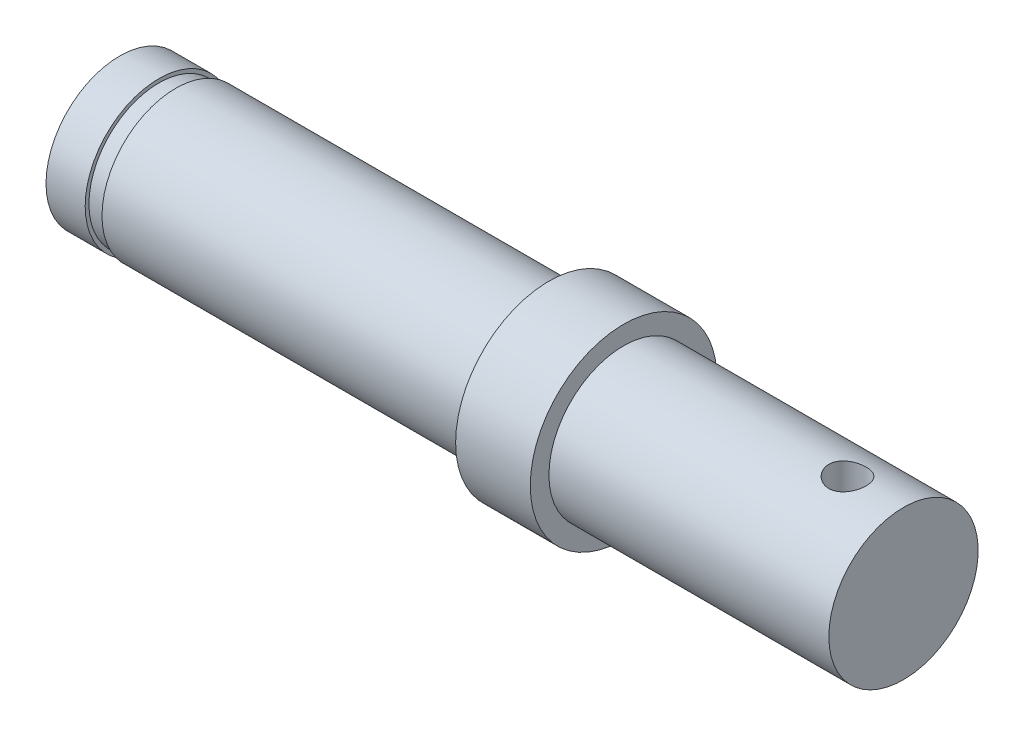
ISO-10303-21;
HEADER;
FILE_DESCRIPTION(('STEP AP214'),'2;1');
FILE_NAME('part.step','',(''),(''),'','','');
FILE_SCHEMA(('AUTOMOTIVE_DESIGN { 1 0 10303 214 1 1 1 1 }'));
ENDSEC;
DATA;
#1=APPLICATION_CONTEXT('core data for automotive mechanical design processes');
#2=APPLICATION_PROTOCOL_DEFINITION('international standard','automotive_design',2000,#1);
#3=PRODUCT_CONTEXT('',#1,'mechanical');
#4=PRODUCT('Part','Part','',(#3));
#5=PRODUCT_RELATED_PRODUCT_CATEGORY('part','',(#4));
#6=PRODUCT_DEFINITION_FORMATION('','',#4);
#7=PRODUCT_DEFINITION_CONTEXT('part definition',#1,'design');
#8=PRODUCT_DEFINITION('design','',#6,#7);
#9=PRODUCT_DEFINITION_SHAPE('','',#8);
#10=(LENGTH_UNIT() NAMED_UNIT(*) SI_UNIT(.MILLI.,.METRE.));
#11=(NAMED_UNIT(*) PLANE_ANGLE_UNIT() SI_UNIT($,.RADIAN.));
#12=(NAMED_UNIT(*) SI_UNIT($,.STERADIAN.) SOLID_ANGLE_UNIT());
#13=UNCERTAINTY_MEASURE_WITH_UNIT(LENGTH_MEASURE(1.E-05),#10,'distance_accuracy_value','');
#14=(GEOMETRIC_REPRESENTATION_CONTEXT(3) GLOBAL_UNCERTAINTY_ASSIGNED_CONTEXT((#13)) GLOBAL_UNIT_ASSIGNED_CONTEXT((#10,
#11,#12)) REPRESENTATION_CONTEXT('',''));
#15=CARTESIAN_POINT('',(0.,0.,0.));
#16=DIRECTION('',(0.,0.,1.));
#17=DIRECTION('',(1.,0.,0.));
#18=AXIS2_PLACEMENT_3D('',#15,#16,#17);
#19=CARTESIAN_POINT('',(-15.4994299751339,3.95,0.));
#20=DIRECTION('',(1.,0.,0.));
#21=DIRECTION('',(0.,0.,-1.));
#22=AXIS2_PLACEMENT_3D('',#19,#20,#21);
#23=PLANE('',#22);
#24=CARTESIAN_POINT('',(-15.4994299751339,0.,0.));
#25=DIRECTION('',(-1.,0.,0.));
#26=DIRECTION('',(0.,0.,1.));
#27=AXIS2_PLACEMENT_3D('',#24,#25,#26);
#28=CIRCLE('',#27,3.95);
#29=CARTESIAN_POINT('',(-15.4994299751339,0.,3.95));
#30=VERTEX_POINT('',#29);
#31=EDGE_CURVE('E122',#30,#30,#28,.T.);
#32=ORIENTED_EDGE('',*,*,#31,.T.);
#33=EDGE_LOOP('',(#32));
#34=FACE_BOUND('',#33,.T.);
#35=ADVANCED_FACE('F45',(#34),#23,.F.);
#36=CARTESIAN_POINT('',(26.5005700248661,0.,0.));
#37=DIRECTION('',(-1.,0.,0.));
#38=DIRECTION('',(0.,0.,1.));
#39=AXIS2_PLACEMENT_3D('',#36,#37,#38);
#40=PLANE('',#39);
#41=CARTESIAN_POINT('',(26.5005700248661,0.,0.));
#42=DIRECTION('',(-1.,0.,0.));
#43=DIRECTION('',(0.,0.,1.));
#44=AXIS2_PLACEMENT_3D('',#41,#42,#43);
#45=CIRCLE('',#44,4.00000000000001);
#46=CARTESIAN_POINT('',(26.5005700248661,0.,4.00000000000001));
#47=VERTEX_POINT('',#46);
#48=EDGE_CURVE('E12',#47,#47,#45,.T.);
#49=ORIENTED_EDGE('',*,*,#48,.F.);
#50=EDGE_LOOP('',(#49));
#51=FACE_BOUND('',#50,.T.);
#52=ADVANCED_FACE('F110',(#51),#40,.F.);
#53=CARTESIAN_POINT('',(-15.4994299751339,0.,0.));
#54=DIRECTION('',(-1.,0.,0.));
#55=DIRECTION('',(0.,0.,1.));
#56=AXIS2_PLACEMENT_3D('',#53,#54,#55);
#57=CYLINDRICAL_SURFACE('',#56,4.);
#58=CARTESIAN_POINT('',(23.5005700248661,-3.87298334620742,1.));
#59=CARTESIAN_POINT('',(23.5557903252229,-3.87298440057185,0.9999984314387));
#60=CARTESIAN_POINT('',(23.6110279842975,-3.87417722499279,0.995410498208071));
#61=CARTESIAN_POINT('',(23.7199170560987,-3.8788074489225,0.977209250194448));
#62=CARTESIAN_POINT('',(23.7735675266461,-3.88224615474181,0.963590682698079));
#63=CARTESIAN_POINT('',(23.8776914401539,-3.89095489813012,0.927796479849636));
#64=CARTESIAN_POINT('',(23.9281688870239,-3.8962225706936,0.905631891140945));
#65=CARTESIAN_POINT('',(24.0246943658786,-3.90799276818328,0.853408456505409));
#66=CARTESIAN_POINT('',(24.0707422096973,-3.91449534553241,0.823349275424507));
#67=CARTESIAN_POINT('',(24.158114682972,-3.92816286540369,0.755483370924519));
#68=CARTESIAN_POINT('',(24.1993274650064,-3.93533839048709,0.717534755081559));
#69=CARTESIAN_POINT('',(24.27487458261,-3.94945150206622,0.635272825640329));
#70=CARTESIAN_POINT('',(24.3092082751147,-3.95638906626692,0.590958917672141));
#71=CARTESIAN_POINT('',(24.3704802119187,-3.96936166208095,0.496458080431566));
#72=CARTESIAN_POINT('',(24.3973085801307,-3.97538274960201,0.446197830478045));
#73=CARTESIAN_POINT('',(24.4420938825273,-3.98572324770431,0.34170527371711));
#74=CARTESIAN_POINT('',(24.4600521256323,-3.99004290933748,0.287473554316778));
#75=CARTESIAN_POINT('',(24.4862291586975,-3.99641903539263,0.177743503501663));
#76=CARTESIAN_POINT('',(24.4946378825967,-3.99851957537724,0.12229308781959));
#77=CARTESIAN_POINT('',(24.5020733765763,-4.00037437642922,0.0107315277051081));
#78=CARTESIAN_POINT('',(24.5011015337499,-4.00012898438683,-0.0453795178152274));
#79=CARTESIAN_POINT('',(24.4899400847661,-3.99735237981414,-0.155352247172388));
#80=CARTESIAN_POINT('',(24.4799554948446,-3.9948720093635,-0.209236215601067));
#81=CARTESIAN_POINT('',(24.4513815168467,-3.98796334609942,-0.314538247413687));
#82=CARTESIAN_POINT('',(24.4327916707151,-3.98353494959377,-0.365956179370439));
#83=CARTESIAN_POINT('',(24.3873689965913,-3.97315003880359,-0.465406703501807));
#84=CARTESIAN_POINT('',(24.3604632070014,-3.96718007878022,-0.513404509766505));
#85=CARTESIAN_POINT('',(24.2992277532196,-3.9543596152386,-0.604275622340489));
#86=CARTESIAN_POINT('',(24.2648967974419,-3.94750895860996,-0.647148035085506));
#87=CARTESIAN_POINT('',(24.1886865280732,-3.93345485507809,-0.727774035084958));
#88=CARTESIAN_POINT('',(24.146628067927,-3.92624687810368,-0.765357679075201));
#89=CARTESIAN_POINT('',(24.05673003545,-3.91246017406683,-0.83297637596302));
#90=CARTESIAN_POINT('',(24.0088901930697,-3.90588147642389,-0.863011076046018));
#91=CARTESIAN_POINT('',(23.9084540112065,-3.8940819873266,-0.914788129022599));
#92=CARTESIAN_POINT('',(23.8558357327408,-3.88886793490289,-0.936489566970492));
#93=CARTESIAN_POINT('',(23.7475358376355,-3.88047456055983,-0.970685620636342));
#94=CARTESIAN_POINT('',(23.6918548792729,-3.87729480324088,-0.983182206552911));
#95=CARTESIAN_POINT('',(23.5805862242569,-3.87342142415657,-0.998331855466072));
#96=CARTESIAN_POINT('',(23.5250349075343,-3.8726643563746,-1.00123618956785));
#97=CARTESIAN_POINT('',(23.4142412502348,-3.87354937392416,-0.99780679620622));
#98=CARTESIAN_POINT('',(23.3589988816856,-3.87519123840507,-0.991473919139521));
#99=CARTESIAN_POINT('',(23.2513243188842,-3.88062832781825,-0.969970185575066));
#100=CARTESIAN_POINT('',(23.1988609342378,-3.8843878809375,-0.954945627312699));
#101=CARTESIAN_POINT('',(23.0971974417254,-3.89360287308385,-0.916647232668249));
#102=CARTESIAN_POINT('',(23.047997721244,-3.89905851299446,-0.89337241908502));
#103=CARTESIAN_POINT('',(22.9531935137192,-3.91118454837305,-0.838708267174625));
#104=CARTESIAN_POINT('',(22.9076784888489,-3.91787667442657,-0.807168701534253));
#105=CARTESIAN_POINT('',(22.8224946797456,-3.93166833228687,-0.737060292934457));
#106=CARTESIAN_POINT('',(22.7828268582061,-3.93876793091388,-0.698490294805441));
#107=CARTESIAN_POINT('',(22.7094456078377,-3.95278961212643,-0.614262720984727));
#108=CARTESIAN_POINT('',(22.6759059998466,-3.95970280824735,-0.568451952531595));
#109=CARTESIAN_POINT('',(22.6169956780856,-3.97238886645494,-0.471702682694678));
#110=CARTESIAN_POINT('',(22.5916245382228,-3.97816178801584,-0.420764448957592));
#111=CARTESIAN_POINT('',(22.5499916110549,-3.98788046295326,-0.315558201731091));
#112=CARTESIAN_POINT('',(22.5336643111145,-3.99183932008964,-0.261317381027882));
#113=CARTESIAN_POINT('',(22.5103858910227,-3.99754117358316,-0.150749760318808));
#114=CARTESIAN_POINT('',(22.5034329613705,-3.99928459757364,-0.094423365041244));
#115=CARTESIAN_POINT('',(22.4992024352906,-4.00034169408812,0.0170835264433263));
#116=CARTESIAN_POINT('',(22.5016683157707,-3.99971978880009,0.0722538269660332));
#117=CARTESIAN_POINT('',(22.5156178521604,-3.99625896457424,0.18136749641474));
#118=CARTESIAN_POINT('',(22.5271012398792,-3.99342011157095,0.235310901780887));
#119=CARTESIAN_POINT('',(22.558622244637,-3.98585432853964,0.340171035644816));
#120=CARTESIAN_POINT('',(22.5786134781807,-3.98113764502669,0.391102494581019));
#121=CARTESIAN_POINT('',(22.6265406038854,-3.97031288913382,0.488917053041468));
#122=CARTESIAN_POINT('',(22.6544774975357,-3.96420464137727,0.535799641265051));
#123=CARTESIAN_POINT('',(22.7182852588632,-3.95107249681343,0.625401928423901));
#124=CARTESIAN_POINT('',(22.7543301677735,-3.94403016945647,0.667994988300587));
#125=CARTESIAN_POINT('',(22.8329928768399,-3.92990649053207,0.746615020271252));
#126=CARTESIAN_POINT('',(22.8756123409641,-3.92282512952424,0.782640325068179));
#127=CARTESIAN_POINT('',(22.9671714390674,-3.90927475860683,0.847762026479241));
#128=CARTESIAN_POINT('',(23.0162141482786,-3.90281963730391,0.876716619446594));
#129=CARTESIAN_POINT('',(23.118625514789,-3.8914395555011,0.925926896615623));
#130=CARTESIAN_POINT('',(23.1719909909734,-3.88651348244815,0.946188909759558));
#131=CARTESIAN_POINT('',(23.2711470366924,-3.87951908741315,0.974422528565573));
#132=CARTESIAN_POINT('',(23.3164631892485,-3.87708663005762,0.98399317059583));
#133=CARTESIAN_POINT('',(23.4080388938676,-3.87381838580358,0.996782292572821));
#134=CARTESIAN_POINT('',(23.4542983651167,-3.87298246270639,1.00000131437052));
#135=CARTESIAN_POINT('',(23.5005700248661,-3.87298334620742,1.));
#136=B_SPLINE_CURVE_WITH_KNOTS('',3,(#58,#59,#60,#61,#62,#63,#64,#65,#66,#67,#68,#69,#70,#71,
#72,#73,#74,#75,#76,#77,#78,#79,#80,#81,#82,#83,#84,#85,#86,#87,#88,#89,#90,#91,#92,#93,#94,#95,
#96,#97,#98,#99,#100,#101,#102,#103,#104,#105,#106,#107,#108,#109,#110,#111,#112,#113,#114,#115,
#116,#117,#118,#119,#120,#121,#122,#123,#124,#125,#126,#127,#128,#129,#130,#131,#132,#133,#134,
#135),.UNSPECIFIED.,.T.,.F.,(4,2,2,2,2,2,2,2,2,2,2,2,2,2,2,2,2,2,2,2,2,2,2,2,2,2,2,2,2,2,2,2,2,
2,2,2,2,2,4),(0.,0.16549097667523,0.331078296534212,0.496452290829149,0.66183330698466,
0.83049581673465,0.999174085882213,1.17020598555443,1.34121263935112,1.50875500394413,
1.67627259462683,1.84007305071854,2.00388222686189,2.16917149698053,2.3344895418384,
2.5042818662504,2.67408212476196,2.84470572799636,3.01529280048094,3.18137429900962,
3.34744050869796,3.51078961999958,3.67415808564842,3.84073138339938,4.00733207550293,
4.17810132382403,4.34886166284097,4.51836829119047,4.6878421955989,4.85273378447258,
5.01762046947068,5.18161950620159,5.34563922291504,5.51358838629104,5.68158012622479,
5.85270590910146,6.02370688542923,6.16239130867208,6.30106390036084),.UNSPECIFIED.);
#137=CARTESIAN_POINT('',(23.5005700248661,-3.87298334620742,1.));
#138=VERTEX_POINT('',#137);
#139=EDGE_CURVE('E48',#138,#138,#136,.T.);
#140=ORIENTED_EDGE('',*,*,#139,.T.);
#141=EDGE_LOOP('',(#140));
#142=FACE_BOUND('',#141,.T.);
#143=CARTESIAN_POINT('',(23.5005700248661,3.87298334620742,1.));
#144=CARTESIAN_POINT('',(23.4453497245093,3.87298440057185,0.9999984314387));
#145=CARTESIAN_POINT('',(23.3901120654347,3.87417722499279,0.99541049820807));
#146=CARTESIAN_POINT('',(23.2812229936335,3.8788074489225,0.977209250194447));
#147=CARTESIAN_POINT('',(23.2275725230861,3.88224615474181,0.963590682698078));
#148=CARTESIAN_POINT('',(23.1234486095783,3.89095489813012,0.927796479849635));
#149=CARTESIAN_POINT('',(23.0729711627083,3.8962225706936,0.905631891140943));
#150=CARTESIAN_POINT('',(22.9764456838536,3.90799276818328,0.853408456505406));
#151=CARTESIAN_POINT('',(22.930397840035,3.91449534553241,0.823349275424505));
#152=CARTESIAN_POINT('',(22.8430253667603,3.92816286540369,0.755483370924519));
#153=CARTESIAN_POINT('',(22.8018125847258,3.93533839048709,0.717534755081559));
#154=CARTESIAN_POINT('',(22.7262654671222,3.94945150206622,0.635272825640329));
#155=CARTESIAN_POINT('',(22.6919317746175,3.95638906626692,0.590958917672141));
#156=CARTESIAN_POINT('',(22.6306598378135,3.96936166208095,0.496458080431566));
#157=CARTESIAN_POINT('',(22.6038314696015,3.97538274960201,0.446197830478045));
#158=CARTESIAN_POINT('',(22.5590461672049,3.98572324770431,0.34170527371711));
#159=CARTESIAN_POINT('',(22.5410879240999,3.99004290933748,0.287473554316778));
#160=CARTESIAN_POINT('',(22.5149108910347,3.99641903539263,0.177743503501663));
#161=CARTESIAN_POINT('',(22.5065021671355,3.99851957537724,0.12229308781959));
#162=CARTESIAN_POINT('',(22.4990666731559,4.00037437642922,0.0107315277051081));
#163=CARTESIAN_POINT('',(22.5000385159823,4.00012898438683,-0.0453795178152274));
#164=CARTESIAN_POINT('',(22.5111999649662,3.99735237981414,-0.155352247172388));
#165=CARTESIAN_POINT('',(22.5211845548877,3.9948720093635,-0.209236215601067));
#166=CARTESIAN_POINT('',(22.5497585328855,3.98796334609942,-0.314538247413687));
#167=CARTESIAN_POINT('',(22.5683483790171,3.98353494959377,-0.365956179370439));
#168=CARTESIAN_POINT('',(22.6137710531409,3.97315003880359,-0.465406703501807));
#169=CARTESIAN_POINT('',(22.6406768427308,3.96718007878022,-0.513404509766505));
#170=CARTESIAN_POINT('',(22.7019122965126,3.9543596152386,-0.604275622340489));
#171=CARTESIAN_POINT('',(22.7362432522904,3.94750895860996,-0.647148035085506));
#172=CARTESIAN_POINT('',(22.8124535216591,3.93345485507809,-0.727774035084958));
#173=CARTESIAN_POINT('',(22.8545119818052,3.92624687810368,-0.765357679075201));
#174=CARTESIAN_POINT('',(22.9444100142822,3.91246017406683,-0.83297637596302));
#175=CARTESIAN_POINT('',(22.9922498566625,3.90588147642389,-0.863011076046018));
#176=CARTESIAN_POINT('',(23.0926860385257,3.8940819873266,-0.914788129022599));
#177=CARTESIAN_POINT('',(23.1453043169914,3.88886793490289,-0.936489566970492));
#178=CARTESIAN_POINT('',(23.2536042120967,3.88047456055983,-0.970685620636342));
#179=CARTESIAN_POINT('',(23.3092851704594,3.87729480324088,-0.983182206552911));
#180=CARTESIAN_POINT('',(23.4205538254754,3.87342142415657,-0.998331855466072));
#181=CARTESIAN_POINT('',(23.476105142198,3.8726643563746,-1.00123618956785));
#182=CARTESIAN_POINT('',(23.5868987994974,3.87354937392416,-0.99780679620622));
#183=CARTESIAN_POINT('',(23.6421411680466,3.87519123840507,-0.991473919139521));
#184=CARTESIAN_POINT('',(23.749815730848,3.88062832781825,-0.969970185575066));
#185=CARTESIAN_POINT('',(23.8022791154944,3.8843878809375,-0.954945627312699));
#186=CARTESIAN_POINT('',(23.9039426080068,3.89360287308385,-0.916647232668249));
#187=CARTESIAN_POINT('',(23.9531423284882,3.89905851299446,-0.89337241908502));
#188=CARTESIAN_POINT('',(24.047946536013,3.91118454837305,-0.838708267174625));
#189=CARTESIAN_POINT('',(24.0934615608833,3.91787667442657,-0.807168701534253));
#190=CARTESIAN_POINT('',(24.1786453699866,3.93166833228687,-0.737060292934457));
#191=CARTESIAN_POINT('',(24.2183131915261,3.93876793091388,-0.69849029480544));
#192=CARTESIAN_POINT('',(24.2916944418945,3.95278961212643,-0.614262720984726));
#193=CARTESIAN_POINT('',(24.3252340498856,3.95970280824735,-0.568451952531593));
#194=CARTESIAN_POINT('',(24.3841443716466,3.97238886645494,-0.471702682694676));
#195=CARTESIAN_POINT('',(24.4095155115094,3.97816178801584,-0.420764448957591));
#196=CARTESIAN_POINT('',(24.4511484386773,3.98788046295326,-0.315558201731091));
#197=CARTESIAN_POINT('',(24.4674757386177,3.99183932008964,-0.261317381027882));
#198=CARTESIAN_POINT('',(24.4907541587095,3.99754117358316,-0.150749760318808));
#199=CARTESIAN_POINT('',(24.4977070883617,3.99928459757364,-0.094423365041244));
#200=CARTESIAN_POINT('',(24.5019376144416,4.00034169408812,0.0170835264433263));
#201=CARTESIAN_POINT('',(24.4994717339615,3.99971978880009,0.0722538269660332));
#202=CARTESIAN_POINT('',(24.4855221975718,3.99625896457424,0.18136749641474));
#203=CARTESIAN_POINT('',(24.474038809853,3.99342011157095,0.235310901780887));
#204=CARTESIAN_POINT('',(24.4425178050952,3.98585432853964,0.340171035644816));
#205=CARTESIAN_POINT('',(24.4225265715515,3.98113764502669,0.391102494581019));
#206=CARTESIAN_POINT('',(24.3745994458468,3.97031288913382,0.488917053041468));
#207=CARTESIAN_POINT('',(24.3466625521965,3.96420464137727,0.535799641265051));
#208=CARTESIAN_POINT('',(24.282854790869,3.95107249681343,0.625401928423901));
#209=CARTESIAN_POINT('',(24.2468098819587,3.94403016945647,0.667994988300587));
#210=CARTESIAN_POINT('',(24.1681471728923,3.92990649053207,0.746615020271252));
#211=CARTESIAN_POINT('',(24.1255277087682,3.92282512952424,0.782640325068179));
#212=CARTESIAN_POINT('',(24.0339686106648,3.90927475860683,0.847762026479241));
#213=CARTESIAN_POINT('',(23.9849259014536,3.90281963730391,0.876716619446594));
#214=CARTESIAN_POINT('',(23.8825145349433,3.8914395555011,0.925926896615623));
#215=CARTESIAN_POINT('',(23.8291490587588,3.88651348244815,0.946188909759558));
#216=CARTESIAN_POINT('',(23.7299930130398,3.87951908741315,0.974422528565573));
#217=CARTESIAN_POINT('',(23.6846768604837,3.87708663005762,0.98399317059583));
#218=CARTESIAN_POINT('',(23.5931011558646,3.87381838580358,0.996782292572821));
#219=CARTESIAN_POINT('',(23.5468416846155,3.87298246270639,1.00000131437052));
#220=CARTESIAN_POINT('',(23.5005700248661,3.87298334620742,1.));
#221=B_SPLINE_CURVE_WITH_KNOTS('',3,(#143,#144,#145,#146,#147,#148,#149,#150,#151,#152,#153,
#154,#155,#156,#157,#158,#159,#160,#161,#162,#163,#164,#165,#166,#167,#168,#169,#170,#171,#172,
#173,#174,#175,#176,#177,#178,#179,#180,#181,#182,#183,#184,#185,#186,#187,#188,#189,#190,#191,
#192,#193,#194,#195,#196,#197,#198,#199,#200,#201,#202,#203,#204,#205,#206,#207,#208,#209,#210,
#211,#212,#213,#214,#215,#216,#217,#218,#219,#220),.UNSPECIFIED.,.T.,.F.,(4,2,2,2,2,2,2,2,2,2,2,
2,2,2,2,2,2,2,2,2,2,2,2,2,2,2,2,2,2,2,2,2,2,2,2,2,2,2,4),(0.,0.165490976675234,
0.331078296534212,0.496452290829157,0.66183330698466,0.83049581673465,0.999174085882213,
1.17020598555443,1.34121263935112,1.50875500394413,1.67627259462683,1.84007305071854,
2.00388222686189,2.16917149698053,2.3344895418384,2.5042818662504,2.67408212476196,
2.84470572799636,3.01529280048094,3.18137429900962,3.34744050869796,3.51078961999958,
3.67415808564842,3.84073138339938,4.00733207550293,4.17810132382403,4.34886166284097,
4.51836829119047,4.6878421955989,4.85273378447258,5.01762046947068,5.18161950620159,
5.34563922291504,5.51358838629104,5.68158012622479,5.85270590910146,6.02370688542923,
6.16239130867208,6.30106390036084),.UNSPECIFIED.);
#222=CARTESIAN_POINT('',(23.5005700248661,3.87298334620742,1.));
#223=VERTEX_POINT('',#222);
#224=EDGE_CURVE('E64',#223,#223,#221,.T.);
#225=ORIENTED_EDGE('',*,*,#224,.T.);
#226=EDGE_LOOP('',(#225));
#227=FACE_BOUND('',#226,.T.);
#228=CARTESIAN_POINT('',(11.5005700248661,0.,0.));
#229=DIRECTION('',(-1.,0.,0.));
#230=DIRECTION('',(0.,0.,1.));
#231=AXIS2_PLACEMENT_3D('',#228,#229,#230);
#232=CIRCLE('',#231,4.);
#233=CARTESIAN_POINT('',(11.5005700248661,0.,4.));
#234=VERTEX_POINT('',#233);
#235=EDGE_CURVE('E56',#234,#234,#232,.T.);
#236=ORIENTED_EDGE('',*,*,#235,.F.);
#237=EDGE_LOOP('',(#236));
#238=FACE_BOUND('',#237,.T.);
#239=ORIENTED_EDGE('',*,*,#48,.T.);
#240=EDGE_LOOP('',(#239));
#241=FACE_BOUND('',#240,.T.);
#242=ADVANCED_FACE('F68',(#142,#227,#238,#241),#57,.T.);
#243=CARTESIAN_POINT('',(11.5005700248661,4.,0.));
#244=DIRECTION('',(-1.,0.,0.));
#245=DIRECTION('',(0.,0.,1.));
#246=AXIS2_PLACEMENT_3D('',#243,#244,#245);
#247=PLANE('',#246);
#248=CARTESIAN_POINT('',(11.5005700248661,0.,0.));
#249=DIRECTION('',(-1.,0.,0.));
#250=DIRECTION('',(0.,0.,1.));
#251=AXIS2_PLACEMENT_3D('',#248,#249,#250);
#252=CIRCLE('',#251,5.);
#253=CARTESIAN_POINT('',(11.5005700248661,0.,5.));
#254=VERTEX_POINT('',#253);
#255=EDGE_CURVE('E61',#254,#254,#252,.T.);
#256=ORIENTED_EDGE('',*,*,#255,.F.);
#257=EDGE_LOOP('',(#256));
#258=FACE_BOUND('',#257,.T.);
#259=ORIENTED_EDGE('',*,*,#235,.T.);
#260=EDGE_LOOP('',(#259));
#261=FACE_BOUND('',#260,.T.);
#262=ADVANCED_FACE('F103',(#258,#261),#247,.F.);
#263=CARTESIAN_POINT('',(-15.4994299751339,0.,0.));
#264=DIRECTION('',(-1.,0.,0.));
#265=DIRECTION('',(0.,0.,1.));
#266=AXIS2_PLACEMENT_3D('',#263,#264,#265);
#267=CYLINDRICAL_SURFACE('',#266,5.);
#268=CARTESIAN_POINT('',(7.50057002486611,0.,0.));
#269=DIRECTION('',(-1.,0.,0.));
#270=DIRECTION('',(0.,0.,1.));
#271=AXIS2_PLACEMENT_3D('',#268,#269,#270);
#272=CIRCLE('',#271,5.);
#273=CARTESIAN_POINT('',(7.50057002486611,0.,5.));
#274=VERTEX_POINT('',#273);
#275=EDGE_CURVE('E141',#274,#274,#272,.T.);
#276=ORIENTED_EDGE('',*,*,#275,.F.);
#277=EDGE_LOOP('',(#276));
#278=FACE_BOUND('',#277,.T.);
#279=ORIENTED_EDGE('',*,*,#255,.T.);
#280=EDGE_LOOP('',(#279));
#281=FACE_BOUND('',#280,.T.);
#282=ADVANCED_FACE('F100',(#278,#281),#267,.T.);
#283=CARTESIAN_POINT('',(7.50057002486611,5.,0.));
#284=DIRECTION('',(1.,0.,0.));
#285=DIRECTION('',(0.,0.,-1.));
#286=AXIS2_PLACEMENT_3D('',#283,#284,#285);
#287=PLANE('',#286);
#288=CARTESIAN_POINT('',(7.5005700248661,0.,0.));
#289=DIRECTION('',(-1.,0.,0.));
#290=DIRECTION('',(0.,0.,1.));
#291=AXIS2_PLACEMENT_3D('',#288,#289,#290);
#292=CIRCLE('',#291,3.95);
#293=CARTESIAN_POINT('',(7.5005700248661,0.,3.95));
#294=VERTEX_POINT('',#293);
#295=EDGE_CURVE('E138',#294,#294,#292,.T.);
#296=ORIENTED_EDGE('',*,*,#295,.F.);
#297=EDGE_LOOP('',(#296));
#298=FACE_BOUND('',#297,.T.);
#299=ORIENTED_EDGE('',*,*,#275,.T.);
#300=EDGE_LOOP('',(#299));
#301=FACE_BOUND('',#300,.T.);
#302=ADVANCED_FACE('F96',(#298,#301),#287,.F.);
#303=CARTESIAN_POINT('',(-15.4994299751339,0.,0.));
#304=DIRECTION('',(-1.,0.,0.));
#305=DIRECTION('',(0.,0.,1.));
#306=AXIS2_PLACEMENT_3D('',#303,#304,#305);
#307=CYLINDRICAL_SURFACE('',#306,3.95);
#308=CARTESIAN_POINT('',(-12.4994299751339,0.,0.));
#309=DIRECTION('',(-1.,0.,0.));
#310=DIRECTION('',(0.,0.,1.));
#311=AXIS2_PLACEMENT_3D('',#308,#309,#310);
#312=CIRCLE('',#311,3.95);
#313=CARTESIAN_POINT('',(-12.4994299751339,0.,3.95));
#314=VERTEX_POINT('',#313);
#315=EDGE_CURVE('E135',#314,#314,#312,.T.);
#316=ORIENTED_EDGE('',*,*,#315,.F.);
#317=EDGE_LOOP('',(#316));
#318=FACE_BOUND('',#317,.T.);
#319=ORIENTED_EDGE('',*,*,#295,.T.);
#320=EDGE_LOOP('',(#319));
#321=FACE_BOUND('',#320,.T.);
#322=ADVANCED_FACE('F92',(#318,#321),#307,.T.);
#323=CARTESIAN_POINT('',(-12.4994299751339,3.75,0.));
#324=DIRECTION('',(1.,0.,0.));
#325=DIRECTION('',(0.,0.,-1.));
#326=AXIS2_PLACEMENT_3D('',#323,#324,#325);
#327=PLANE('',#326);
#328=CARTESIAN_POINT('',(-12.4994299751339,0.,0.));
#329=DIRECTION('',(-1.,0.,0.));
#330=DIRECTION('',(0.,0.,1.));
#331=AXIS2_PLACEMENT_3D('',#328,#329,#330);
#332=CIRCLE('',#331,3.75);
#333=CARTESIAN_POINT('',(-12.4994299751339,0.,3.75));
#334=VERTEX_POINT('',#333);
#335=EDGE_CURVE('E132',#334,#334,#332,.T.);
#336=ORIENTED_EDGE('',*,*,#335,.F.);
#337=EDGE_LOOP('',(#336));
#338=FACE_BOUND('',#337,.T.);
#339=ORIENTED_EDGE('',*,*,#315,.T.);
#340=EDGE_LOOP('',(#339));
#341=FACE_BOUND('',#340,.T.);
#342=ADVANCED_FACE('F88',(#338,#341),#327,.F.);
#343=CARTESIAN_POINT('',(-15.4994299751339,0.,0.));
#344=DIRECTION('',(-1.,0.,0.));
#345=DIRECTION('',(0.,0.,1.));
#346=AXIS2_PLACEMENT_3D('',#343,#344,#345);
#347=CYLINDRICAL_SURFACE('',#346,3.75);
#348=CARTESIAN_POINT('',(-13.3994299751339,0.,0.));
#349=DIRECTION('',(-1.,0.,0.));
#350=DIRECTION('',(0.,0.,1.));
#351=AXIS2_PLACEMENT_3D('',#348,#349,#350);
#352=CIRCLE('',#351,3.75);
#353=CARTESIAN_POINT('',(-13.3994299751339,0.,3.75));
#354=VERTEX_POINT('',#353);
#355=EDGE_CURVE('E126',#354,#354,#352,.T.);
#356=ORIENTED_EDGE('',*,*,#355,.F.);
#357=EDGE_LOOP('',(#356));
#358=FACE_BOUND('',#357,.T.);
#359=ORIENTED_EDGE('',*,*,#335,.T.);
#360=EDGE_LOOP('',(#359));
#361=FACE_BOUND('',#360,.T.);
#362=ADVANCED_FACE('F84',(#358,#361),#347,.T.);
#363=CARTESIAN_POINT('',(-13.3994299751339,3.95,0.));
#364=DIRECTION('',(-1.,0.,0.));
#365=DIRECTION('',(0.,0.,1.));
#366=AXIS2_PLACEMENT_3D('',#363,#364,#365);
#367=PLANE('',#366);
#368=CARTESIAN_POINT('',(-13.3994299751339,0.,0.));
#369=DIRECTION('',(-1.,0.,0.));
#370=DIRECTION('',(0.,0.,1.));
#371=AXIS2_PLACEMENT_3D('',#368,#369,#370);
#372=CIRCLE('',#371,3.95);
#373=CARTESIAN_POINT('',(-13.3994299751339,0.,3.95));
#374=VERTEX_POINT('',#373);
#375=EDGE_CURVE('E123',#374,#374,#372,.T.);
#376=ORIENTED_EDGE('',*,*,#375,.F.);
#377=EDGE_LOOP('',(#376));
#378=FACE_BOUND('',#377,.T.);
#379=ORIENTED_EDGE('',*,*,#355,.T.);
#380=EDGE_LOOP('',(#379));
#381=FACE_BOUND('',#380,.T.);
#382=ADVANCED_FACE('F80',(#378,#381),#367,.F.);
#383=CARTESIAN_POINT('',(-15.4994299751339,0.,0.));
#384=DIRECTION('',(-1.,0.,0.));
#385=DIRECTION('',(0.,0.,1.));
#386=AXIS2_PLACEMENT_3D('',#383,#384,#385);
#387=CYLINDRICAL_SURFACE('',#386,3.95);
#388=ORIENTED_EDGE('',*,*,#31,.F.);
#389=EDGE_LOOP('',(#388));
#390=FACE_BOUND('',#389,.T.);
#391=ORIENTED_EDGE('',*,*,#375,.T.);
#392=EDGE_LOOP('',(#391));
#393=FACE_BOUND('',#392,.T.);
#394=ADVANCED_FACE('F75',(#390,#393),#387,.T.);
#395=CARTESIAN_POINT('',(23.5005700248661,-5.,0.));
#396=DIRECTION('',(0.,1.,0.));
#397=DIRECTION('',(0.,0.,1.));
#398=AXIS2_PLACEMENT_3D('',#395,#396,#397);
#399=CYLINDRICAL_SURFACE('',#398,1.);
#400=ORIENTED_EDGE('',*,*,#224,.F.);
#401=EDGE_LOOP('',(#400));
#402=FACE_BOUND('',#401,.T.);
#403=ORIENTED_EDGE('',*,*,#139,.F.);
#404=EDGE_LOOP('',(#403));
#405=FACE_BOUND('',#404,.T.);
#406=ADVANCED_FACE('F71',(#402,#405),#399,.F.);
#407=CLOSED_SHELL('',(#35,#52,#242,#262,#282,#302,#322,#342,#362,#382,#394,#406));
#408=MANIFOLD_SOLID_BREP('B2',#407);
#409=ADVANCED_BREP_SHAPE_REPRESENTATION('',(#18,#408),#14);
#410=SHAPE_DEFINITION_REPRESENTATION(#9,#409);
ENDSEC;
END-ISO-10303-21;
